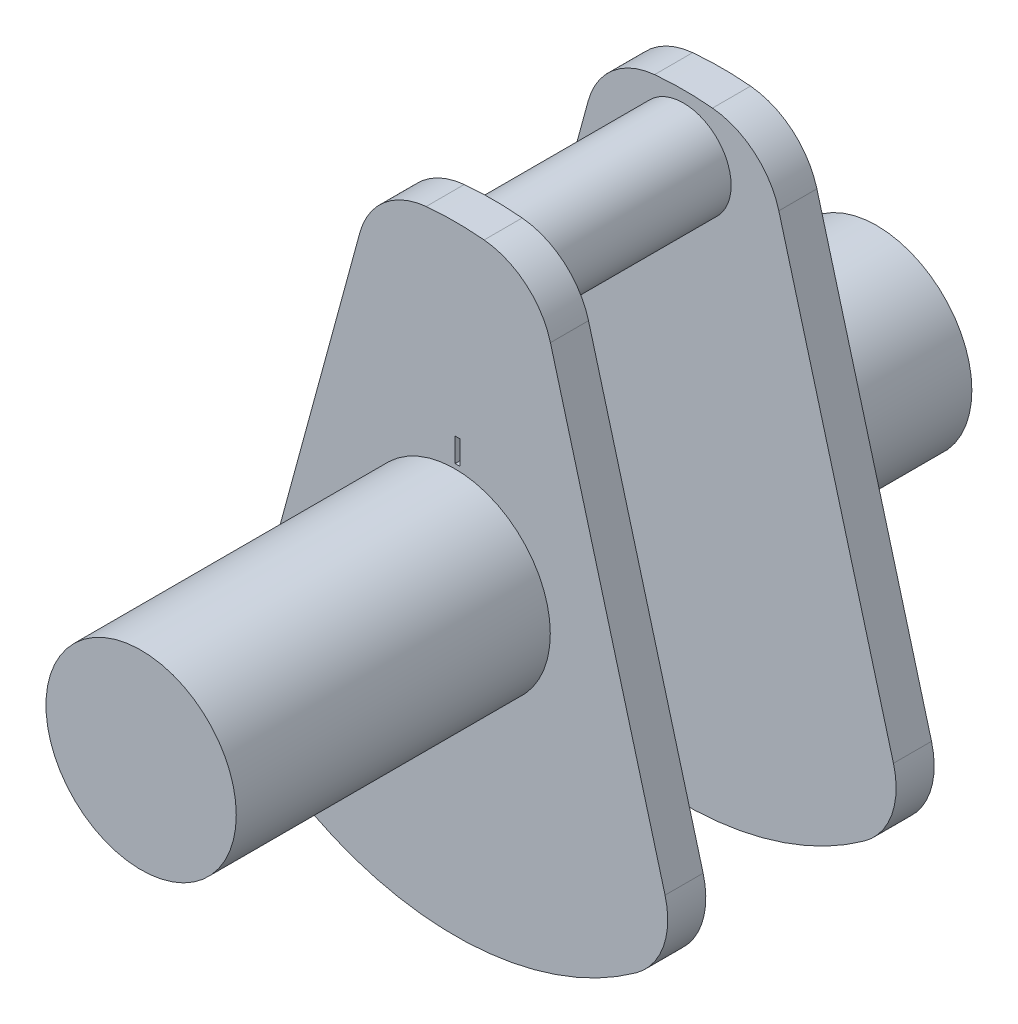
ISO-10303-21;
HEADER;
FILE_DESCRIPTION(('STEP AP214'),'2;1');
FILE_NAME('part.step','',(''),(''),'','','');
FILE_SCHEMA(('AUTOMOTIVE_DESIGN { 1 0 10303 214 1 1 1 1 }'));
ENDSEC;
DATA;
#1=APPLICATION_CONTEXT('core data for automotive mechanical design processes');
#2=APPLICATION_PROTOCOL_DEFINITION('international standard','automotive_design',2000,#1);
#3=PRODUCT_CONTEXT('',#1,'mechanical');
#4=PRODUCT('Part','Part','',(#3));
#5=PRODUCT_RELATED_PRODUCT_CATEGORY('part','',(#4));
#6=PRODUCT_DEFINITION_FORMATION('','',#4);
#7=PRODUCT_DEFINITION_CONTEXT('part definition',#1,'design');
#8=PRODUCT_DEFINITION('design','',#6,#7);
#9=PRODUCT_DEFINITION_SHAPE('','',#8);
#10=(LENGTH_UNIT() NAMED_UNIT(*) SI_UNIT(.MILLI.,.METRE.));
#11=(NAMED_UNIT(*) PLANE_ANGLE_UNIT() SI_UNIT($,.RADIAN.));
#12=(NAMED_UNIT(*) SI_UNIT($,.STERADIAN.) SOLID_ANGLE_UNIT());
#13=UNCERTAINTY_MEASURE_WITH_UNIT(LENGTH_MEASURE(1.E-05),#10,'distance_accuracy_value','');
#14=(GEOMETRIC_REPRESENTATION_CONTEXT(3) GLOBAL_UNCERTAINTY_ASSIGNED_CONTEXT((#13)) GLOBAL_UNIT_ASSIGNED_CONTEXT((#10,
#11,#12)) REPRESENTATION_CONTEXT('',''));
#15=CARTESIAN_POINT('',(0.,0.,0.));
#16=DIRECTION('',(0.,0.,1.));
#17=DIRECTION('',(1.,0.,0.));
#18=AXIS2_PLACEMENT_3D('',#15,#16,#17);
#19=CARTESIAN_POINT('',(0.459000000000004,3.78337793824868,36.9249720179287));
#20=DIRECTION('',(0.,0.,-1.));
#21=DIRECTION('',(-1.,0.,0.));
#22=AXIS2_PLACEMENT_3D('',#19,#20,#21);
#23=CYLINDRICAL_SURFACE('',#22,1.6);
#24=CARTESIAN_POINT('',(0.459000000000004,3.78337793824868,36.1249720179287));
#25=DIRECTION('',(0.,0.,1.));
#26=DIRECTION('',(1.,0.,0.));
#27=AXIS2_PLACEMENT_3D('',#24,#25,#26);
#28=CIRCLE('',#27,1.6);
#29=CARTESIAN_POINT('',(2.00284320160388,4.20355429272558,36.1249720179287));
#30=VERTEX_POINT('',#29);
#31=CARTESIAN_POINT('',(0.608877551020411,5.37634269608236,36.1249720179287));
#32=VERTEX_POINT('',#31);
#33=EDGE_CURVE('E164',#30,#32,#28,.T.);
#34=ORIENTED_EDGE('',*,*,#33,.T.);
#35=DIRECTION('',(0.,0.,-1.));
#36=VECTOR('',#35,1.);
#37=CARTESIAN_POINT('',(0.608877551020411,5.37634269608236,36.9249720179287));
#38=LINE('',#37,#36);
#39=CARTESIAN_POINT('',(0.608877551020411,5.37634269608236,36.9249720179287));
#40=VERTEX_POINT('',#39);
#41=EDGE_CURVE('E57',#40,#32,#38,.T.);
#42=ORIENTED_EDGE('',*,*,#41,.F.);
#43=CARTESIAN_POINT('',(0.459000000000004,3.78337793824868,36.9249720179287));
#44=DIRECTION('',(0.,0.,1.));
#45=DIRECTION('',(1.,0.,0.));
#46=AXIS2_PLACEMENT_3D('',#43,#44,#45);
#47=CIRCLE('',#46,1.6);
#48=CARTESIAN_POINT('',(2.00284320160388,4.20355429272558,36.9249720179287));
#49=VERTEX_POINT('',#48);
#50=EDGE_CURVE('E179',#49,#40,#47,.T.);
#51=ORIENTED_EDGE('',*,*,#50,.F.);
#52=DIRECTION('',(0.,0.,-1.));
#53=VECTOR('',#52,1.);
#54=CARTESIAN_POINT('',(2.00284320160388,4.20355429272558,36.9249720179287));
#55=LINE('',#54,#53);
#56=EDGE_CURVE('E159',#49,#30,#55,.T.);
#57=ORIENTED_EDGE('',*,*,#56,.T.);
#58=EDGE_LOOP('',(#34,#42,#51,#57));
#59=FACE_BOUND('',#58,.T.);
#60=ADVANCED_FACE('F50',(#59),#23,.T.);
#61=CARTESIAN_POINT('',(0.,-1.09507663261698,36.9249720179287));
#62=DIRECTION('',(0.,0.,-1.));
#63=DIRECTION('',(-1.,0.,0.));
#64=AXIS2_PLACEMENT_3D('',#61,#62,#63);
#65=CYLINDRICAL_SURFACE('',#64,6.5);
#66=CARTESIAN_POINT('',(0.,-1.09507663261698,36.1249720179287));
#67=DIRECTION('',(0.,0.,1.));
#68=DIRECTION('',(1.,0.,0.));
#69=AXIS2_PLACEMENT_3D('',#66,#67,#68);
#70=CIRCLE('',#69,6.5);
#71=CARTESIAN_POINT('',(-0.608877551020403,5.37634269608236,36.1249720179287));
#72=VERTEX_POINT('',#71);
#73=EDGE_CURVE('E363',#32,#72,#70,.T.);
#74=ORIENTED_EDGE('',*,*,#73,.T.);
#75=DIRECTION('',(0.,0.,-1.));
#76=VECTOR('',#75,1.);
#77=CARTESIAN_POINT('',(-0.608877551020403,5.37634269608236,36.9249720179287));
#78=LINE('',#77,#76);
#79=CARTESIAN_POINT('',(-0.608877551020403,5.37634269608236,36.9249720179287));
#80=VERTEX_POINT('',#79);
#81=EDGE_CURVE('E196',#80,#72,#78,.T.);
#82=ORIENTED_EDGE('',*,*,#81,.F.);
#83=CARTESIAN_POINT('',(0.,-1.09507663261698,36.9249720179287));
#84=DIRECTION('',(0.,0.,1.));
#85=DIRECTION('',(1.,0.,0.));
#86=AXIS2_PLACEMENT_3D('',#83,#84,#85);
#87=CIRCLE('',#86,6.5);
#88=EDGE_CURVE('E115',#40,#80,#87,.T.);
#89=ORIENTED_EDGE('',*,*,#88,.F.);
#90=ORIENTED_EDGE('',*,*,#41,.T.);
#91=EDGE_LOOP('',(#74,#82,#89,#90));
#92=FACE_BOUND('',#91,.T.);
#93=ADVANCED_FACE('F384',(#92),#65,.T.);
#94=CARTESIAN_POINT('',(-0.458999999999996,3.78337793824868,36.9249720179287));
#95=DIRECTION('',(0.,0.,-1.));
#96=DIRECTION('',(-1.,0.,0.));
#97=AXIS2_PLACEMENT_3D('',#94,#95,#96);
#98=CYLINDRICAL_SURFACE('',#97,1.6);
#99=CARTESIAN_POINT('',(-0.458999999999996,3.78337793824868,36.1249720179287));
#100=DIRECTION('',(0.,0.,1.));
#101=DIRECTION('',(-1.,0.,0.));
#102=AXIS2_PLACEMENT_3D('',#99,#100,#101);
#103=CIRCLE('',#102,1.6);
#104=CARTESIAN_POINT('',(-2.00284320160387,4.20355429272557,36.1249720179287));
#105=VERTEX_POINT('',#104);
#106=EDGE_CURVE('E368',#72,#105,#103,.T.);
#107=ORIENTED_EDGE('',*,*,#106,.T.);
#108=DIRECTION('',(0.,0.,-1.));
#109=VECTOR('',#108,1.);
#110=CARTESIAN_POINT('',(-2.00284320160387,4.20355429272557,36.9249720179287));
#111=LINE('',#110,#109);
#112=CARTESIAN_POINT('',(-2.00284320160387,4.20355429272557,36.9249720179287));
#113=VERTEX_POINT('',#112);
#114=EDGE_CURVE('E192',#113,#105,#111,.T.);
#115=ORIENTED_EDGE('',*,*,#114,.F.);
#116=CARTESIAN_POINT('',(-0.458999999999996,3.78337793824868,36.9249720179287));
#117=DIRECTION('',(0.,0.,1.));
#118=DIRECTION('',(-1.,0.,0.));
#119=AXIS2_PLACEMENT_3D('',#116,#117,#118);
#120=CIRCLE('',#119,1.6);
#121=EDGE_CURVE('E219',#80,#113,#120,.T.);
#122=ORIENTED_EDGE('',*,*,#121,.F.);
#123=ORIENTED_EDGE('',*,*,#81,.T.);
#124=EDGE_LOOP('',(#107,#115,#122,#123));
#125=FACE_BOUND('',#124,.T.);
#126=ADVANCED_FACE('F386',(#125),#98,.T.);
#127=CARTESIAN_POINT('',(-2.00284320160387,4.20355429272557,36.9249720179287));
#128=DIRECTION('',(0.964902001002423,-0.26261022154806,0.));
#129=DIRECTION('',(0.26261022154806,0.964902001002423,0.));
#130=AXIS2_PLACEMENT_3D('',#127,#128,#129);
#131=PLANE('',#130);
#132=DIRECTION('',(-0.26261022154806,-0.964902001002423,0.));
#133=VECTOR('',#132,1.);
#134=CARTESIAN_POINT('',(-2.00284320160387,4.20355429272557,36.1249720179287));
#135=LINE('',#134,#133);
#136=CARTESIAN_POINT('',(-4.41186786120332,-4.64786322182952,36.1249720179287));
#137=VERTEX_POINT('',#136);
#138=EDGE_CURVE('E370',#105,#137,#135,.T.);
#139=ORIENTED_EDGE('',*,*,#138,.T.);
#140=DIRECTION('',(0.,0.,-1.));
#141=VECTOR('',#140,1.);
#142=CARTESIAN_POINT('',(-4.41186786120332,-4.64786322182952,36.9249720179287));
#143=LINE('',#142,#141);
#144=CARTESIAN_POINT('',(-4.41186786120332,-4.64786322182952,36.9249720179287));
#145=VERTEX_POINT('',#144);
#146=EDGE_CURVE('E188',#145,#137,#143,.T.);
#147=ORIENTED_EDGE('',*,*,#146,.F.);
#148=DIRECTION('',(-0.26261022154806,-0.964902001002423,0.));
#149=VECTOR('',#148,1.);
#150=CARTESIAN_POINT('',(-2.00284320160387,4.20355429272557,36.9249720179287));
#151=LINE('',#150,#149);
#152=EDGE_CURVE('E389',#113,#145,#151,.T.);
#153=ORIENTED_EDGE('',*,*,#152,.F.);
#154=ORIENTED_EDGE('',*,*,#114,.T.);
#155=EDGE_LOOP('',(#139,#147,#153,#154));
#156=FACE_BOUND('',#155,.T.);
#157=ADVANCED_FACE('F395',(#156),#131,.F.);
#158=CARTESIAN_POINT('',(-2.86802465959945,-5.06803957630642,36.9249720179287));
#159=DIRECTION('',(0.,0.,-1.));
#160=DIRECTION('',(-1.,0.,0.));
#161=AXIS2_PLACEMENT_3D('',#158,#159,#160);
#162=CYLINDRICAL_SURFACE('',#161,1.6);
#163=CARTESIAN_POINT('',(-2.86802465959945,-5.06803957630642,36.1249720179287));
#164=DIRECTION('',(0.,0.,1.));
#165=DIRECTION('',(1.,0.,0.));
#166=AXIS2_PLACEMENT_3D('',#163,#164,#165);
#167=CIRCLE('',#166,1.6);
#168=CARTESIAN_POINT('',(-3.80452250763193,-6.36533359873562,36.1249720179287));
#169=VERTEX_POINT('',#168);
#170=EDGE_CURVE('E376',#137,#169,#167,.T.);
#171=ORIENTED_EDGE('',*,*,#170,.T.);
#172=DIRECTION('',(0.,0.,-1.));
#173=VECTOR('',#172,1.);
#174=CARTESIAN_POINT('',(-3.80452250763193,-6.36533359873562,36.9249720179287));
#175=LINE('',#174,#173);
#176=CARTESIAN_POINT('',(-3.80452250763193,-6.36533359873562,36.9249720179287));
#177=VERTEX_POINT('',#176);
#178=EDGE_CURVE('E152',#177,#169,#175,.T.);
#179=ORIENTED_EDGE('',*,*,#178,.F.);
#180=CARTESIAN_POINT('',(-2.86802465959945,-5.06803957630642,36.9249720179287));
#181=DIRECTION('',(0.,0.,1.));
#182=DIRECTION('',(1.,0.,0.));
#183=AXIS2_PLACEMENT_3D('',#180,#181,#182);
#184=CIRCLE('',#183,1.6);
#185=EDGE_CURVE('E138',#145,#177,#184,.T.);
#186=ORIENTED_EDGE('',*,*,#185,.F.);
#187=ORIENTED_EDGE('',*,*,#146,.T.);
#188=EDGE_LOOP('',(#171,#179,#186,#187));
#189=FACE_BOUND('',#188,.T.);
#190=ADVANCED_FACE('F399',(#189),#162,.T.);
#191=CARTESIAN_POINT('',(0.,-1.09507663261698,36.9249720179287));
#192=DIRECTION('',(0.,0.,-1.));
#193=DIRECTION('',(-1.,0.,0.));
#194=AXIS2_PLACEMENT_3D('',#191,#192,#193);
#195=CYLINDRICAL_SURFACE('',#194,6.5);
#196=CARTESIAN_POINT('',(0.,-1.09507663261698,36.1249720179287));
#197=DIRECTION('',(0.,0.,1.));
#198=DIRECTION('',(1.,0.,0.));
#199=AXIS2_PLACEMENT_3D('',#196,#197,#198);
#200=CIRCLE('',#199,6.5);
#201=CARTESIAN_POINT('',(3.80452250763193,-6.36533359873562,36.1249720179287));
#202=VERTEX_POINT('',#201);
#203=EDGE_CURVE('E148',#169,#202,#200,.T.);
#204=ORIENTED_EDGE('',*,*,#203,.T.);
#205=DIRECTION('',(0.,0.,-1.));
#206=VECTOR('',#205,1.);
#207=CARTESIAN_POINT('',(3.80452250763193,-6.36533359873562,36.9249720179287));
#208=LINE('',#207,#206);
#209=CARTESIAN_POINT('',(3.80452250763193,-6.36533359873562,36.9249720179287));
#210=VERTEX_POINT('',#209);
#211=EDGE_CURVE('E145',#210,#202,#208,.T.);
#212=ORIENTED_EDGE('',*,*,#211,.F.);
#213=CARTESIAN_POINT('',(0.,-1.09507663261698,36.9249720179287));
#214=DIRECTION('',(0.,0.,1.));
#215=DIRECTION('',(1.,0.,0.));
#216=AXIS2_PLACEMENT_3D('',#213,#214,#215);
#217=CIRCLE('',#216,6.5);
#218=EDGE_CURVE('E131',#177,#210,#217,.T.);
#219=ORIENTED_EDGE('',*,*,#218,.F.);
#220=ORIENTED_EDGE('',*,*,#178,.T.);
#221=EDGE_LOOP('',(#204,#212,#219,#220));
#222=FACE_BOUND('',#221,.T.);
#223=ADVANCED_FACE('F146',(#222),#195,.T.);
#224=CARTESIAN_POINT('',(2.86802465959946,-5.06803957630641,36.9249720179287));
#225=DIRECTION('',(0.,0.,-1.));
#226=DIRECTION('',(-1.,0.,0.));
#227=AXIS2_PLACEMENT_3D('',#224,#225,#226);
#228=CYLINDRICAL_SURFACE('',#227,1.6);
#229=CARTESIAN_POINT('',(2.86802465959946,-5.06803957630641,36.1249720179287));
#230=DIRECTION('',(0.,0.,1.));
#231=DIRECTION('',(-1.,0.,0.));
#232=AXIS2_PLACEMENT_3D('',#229,#230,#231);
#233=CIRCLE('',#232,1.6);
#234=CARTESIAN_POINT('',(4.41186786120333,-4.64786322182952,36.1249720179287));
#235=VERTEX_POINT('',#234);
#236=EDGE_CURVE('E180',#202,#235,#233,.T.);
#237=ORIENTED_EDGE('',*,*,#236,.T.);
#238=DIRECTION('',(0.,0.,-1.));
#239=VECTOR('',#238,1.);
#240=CARTESIAN_POINT('',(4.41186786120333,-4.64786322182952,36.9249720179287));
#241=LINE('',#240,#239);
#242=CARTESIAN_POINT('',(4.41186786120333,-4.64786322182952,36.9249720179287));
#243=VERTEX_POINT('',#242);
#244=EDGE_CURVE('E153',#243,#235,#241,.T.);
#245=ORIENTED_EDGE('',*,*,#244,.F.);
#246=CARTESIAN_POINT('',(2.86802465959946,-5.06803957630641,36.9249720179287));
#247=DIRECTION('',(0.,0.,1.));
#248=DIRECTION('',(-1.,0.,0.));
#249=AXIS2_PLACEMENT_3D('',#246,#247,#248);
#250=CIRCLE('',#249,1.6);
#251=EDGE_CURVE('E135',#210,#243,#250,.T.);
#252=ORIENTED_EDGE('',*,*,#251,.F.);
#253=ORIENTED_EDGE('',*,*,#211,.T.);
#254=EDGE_LOOP('',(#237,#245,#252,#253));
#255=FACE_BOUND('',#254,.T.);
#256=ADVANCED_FACE('F155',(#255),#228,.T.);
#257=CARTESIAN_POINT('',(2.00284320160388,4.20355429272558,36.9249720179287));
#258=DIRECTION('',(-0.964902001002423,-0.26261022154806,0.));
#259=DIRECTION('',(0.26261022154806,-0.964902001002423,0.));
#260=AXIS2_PLACEMENT_3D('',#257,#258,#259);
#261=PLANE('',#260);
#262=DIRECTION('',(-0.26261022154806,0.964902001002423,0.));
#263=VECTOR('',#262,1.);
#264=CARTESIAN_POINT('',(2.00284320160388,4.20355429272558,36.1249720179287));
#265=LINE('',#264,#263);
#266=EDGE_CURVE('E106',#235,#30,#265,.T.);
#267=ORIENTED_EDGE('',*,*,#266,.T.);
#268=ORIENTED_EDGE('',*,*,#56,.F.);
#269=DIRECTION('',(-0.26261022154806,0.964902001002423,0.));
#270=VECTOR('',#269,1.);
#271=CARTESIAN_POINT('',(2.00284320160388,4.20355429272558,36.9249720179287));
#272=LINE('',#271,#270);
#273=EDGE_CURVE('E73',#243,#49,#272,.T.);
#274=ORIENTED_EDGE('',*,*,#273,.F.);
#275=ORIENTED_EDGE('',*,*,#244,.T.);
#276=EDGE_LOOP('',(#267,#268,#274,#275));
#277=FACE_BOUND('',#276,.T.);
#278=ADVANCED_FACE('F380',(#277),#261,.F.);
#279=CARTESIAN_POINT('',(0.459000000000004,3.78337793824868,36.9249720179287));
#280=DIRECTION('',(0.,0.,1.));
#281=DIRECTION('',(1.,0.,0.));
#282=AXIS2_PLACEMENT_3D('',#279,#280,#281);
#283=PLANE('',#282);
#284=CARTESIAN_POINT('',(0.,4.16392336738302,36.9249720179287));
#285=DIRECTION('',(0.,0.,1.));
#286=DIRECTION('',(1.,0.,0.));
#287=AXIS2_PLACEMENT_3D('',#284,#285,#286);
#288=CIRCLE('',#287,1.);
#289=CARTESIAN_POINT('',(1.00000000000001,4.16392336738302,36.9249720179287));
#290=VERTEX_POINT('',#289);
#291=EDGE_CURVE('E206',#290,#290,#288,.T.);
#292=ORIENTED_EDGE('',*,*,#291,.F.);
#293=EDGE_LOOP('',(#292));
#294=FACE_BOUND('',#293,.T.);
#295=ORIENTED_EDGE('',*,*,#50,.T.);
#296=ORIENTED_EDGE('',*,*,#88,.T.);
#297=ORIENTED_EDGE('',*,*,#121,.T.);
#298=ORIENTED_EDGE('',*,*,#152,.T.);
#299=ORIENTED_EDGE('',*,*,#185,.T.);
#300=ORIENTED_EDGE('',*,*,#218,.T.);
#301=ORIENTED_EDGE('',*,*,#251,.T.);
#302=ORIENTED_EDGE('',*,*,#273,.T.);
#303=EDGE_LOOP('',(#295,#296,#297,#298,#299,#300,#301,#302));
#304=FACE_BOUND('',#303,.T.);
#305=ADVANCED_FACE('F133',(#294,#304),#283,.T.);
#306=CARTESIAN_POINT('',(0.459000000000004,3.78337793824868,36.1249720179287));
#307=DIRECTION('',(0.,0.,1.));
#308=DIRECTION('',(1.,0.,0.));
#309=AXIS2_PLACEMENT_3D('',#306,#307,#308);
#310=PLANE('',#309);
#311=CARTESIAN_POINT('',(0.,-1.09507663261698,36.1249720179287));
#312=DIRECTION('',(0.,0.,1.));
#313=DIRECTION('',(1.,0.,0.));
#314=AXIS2_PLACEMENT_3D('',#311,#312,#313);
#315=CIRCLE('',#314,2.);
#316=CARTESIAN_POINT('',(2.,-1.09507663261698,36.1249720179287));
#317=VERTEX_POINT('',#316);
#318=EDGE_CURVE('E12',#317,#317,#315,.F.);
#319=ORIENTED_EDGE('',*,*,#318,.F.);
#320=EDGE_LOOP('',(#319));
#321=FACE_BOUND('',#320,.T.);
#322=ORIENTED_EDGE('',*,*,#33,.F.);
#323=ORIENTED_EDGE('',*,*,#266,.F.);
#324=ORIENTED_EDGE('',*,*,#236,.F.);
#325=ORIENTED_EDGE('',*,*,#203,.F.);
#326=ORIENTED_EDGE('',*,*,#170,.F.);
#327=ORIENTED_EDGE('',*,*,#138,.F.);
#328=ORIENTED_EDGE('',*,*,#106,.F.);
#329=ORIENTED_EDGE('',*,*,#73,.F.);
#330=EDGE_LOOP('',(#322,#323,#324,#325,#326,#327,#328,#329));
#331=FACE_BOUND('',#330,.T.);
#332=ADVANCED_FACE('F356',(#321,#331),#310,.F.);
#333=CARTESIAN_POINT('',(0.,4.16392336738302,38.9249720179287));
#334=DIRECTION('',(0.,0.,-1.));
#335=DIRECTION('',(-1.,0.,0.));
#336=AXIS2_PLACEMENT_3D('',#333,#334,#335);
#337=CYLINDRICAL_SURFACE('',#336,1.);
#338=ORIENTED_EDGE('',*,*,#291,.T.);
#339=EDGE_LOOP('',(#338));
#340=FACE_BOUND('',#339,.T.);
#341=CARTESIAN_POINT('',(0.,4.16392336738302,40.9249720179287));
#342=DIRECTION('',(0.,0.,1.));
#343=DIRECTION('',(1.,0.,0.));
#344=AXIS2_PLACEMENT_3D('',#341,#342,#343);
#345=CIRCLE('',#344,1.);
#346=CARTESIAN_POINT('',(1.00000000000001,4.16392336738302,40.9249720179287));
#347=VERTEX_POINT('',#346);
#348=EDGE_CURVE('E266',#347,#347,#345,.T.);
#349=ORIENTED_EDGE('',*,*,#348,.F.);
#350=EDGE_LOOP('',(#349));
#351=FACE_BOUND('',#350,.T.);
#352=ADVANCED_FACE('F352',(#340,#351),#337,.T.);
#353=CARTESIAN_POINT('',(0.,-1.09507663261698,32.8649720179287));
#354=DIRECTION('',(0.,0.,1.));
#355=DIRECTION('',(1.,0.,0.));
#356=AXIS2_PLACEMENT_3D('',#353,#354,#355);
#357=CYLINDRICAL_SURFACE('',#356,2.);
#358=CARTESIAN_POINT('',(0.,-1.09507663261698,32.8649720179287));
#359=DIRECTION('',(0.,0.,-1.));
#360=DIRECTION('',(-1.,0.,0.));
#361=AXIS2_PLACEMENT_3D('',#358,#359,#360);
#362=CIRCLE('',#361,2.);
#363=CARTESIAN_POINT('',(-2.,-1.09507663261698,32.8649720179287));
#364=VERTEX_POINT('',#363);
#365=EDGE_CURVE('E212',#364,#364,#362,.T.);
#366=ORIENTED_EDGE('',*,*,#365,.F.);
#367=EDGE_LOOP('',(#366));
#368=FACE_BOUND('',#367,.T.);
#369=ORIENTED_EDGE('',*,*,#318,.T.);
#370=EDGE_LOOP('',(#369));
#371=FACE_BOUND('',#370,.T.);
#372=ADVANCED_FACE('F349',(#368,#371),#357,.T.);
#373=CARTESIAN_POINT('',(0.,-1.09507663261698,32.8649720179287));
#374=DIRECTION('',(0.,0.,-1.));
#375=DIRECTION('',(-1.,0.,0.));
#376=AXIS2_PLACEMENT_3D('',#373,#374,#375);
#377=PLANE('',#376);
#378=ORIENTED_EDGE('',*,*,#365,.T.);
#379=EDGE_LOOP('',(#378));
#380=FACE_BOUND('',#379,.T.);
#381=ADVANCED_FACE('F347',(#380),#377,.T.);
#382=CARTESIAN_POINT('',(0.459000000000004,3.78337793824868,40.9249720179287));
#383=DIRECTION('',(0.,0.,1.));
#384=DIRECTION('',(-1.,0.,0.));
#385=AXIS2_PLACEMENT_3D('',#382,#383,#384);
#386=CYLINDRICAL_SURFACE('',#385,1.6);
#387=CARTESIAN_POINT('',(0.459000000000004,3.78337793824868,41.7249720179287));
#388=DIRECTION('',(0.,0.,1.));
#389=DIRECTION('',(1.,0.,0.));
#390=AXIS2_PLACEMENT_3D('',#387,#388,#389);
#391=CIRCLE('',#390,1.6);
#392=CARTESIAN_POINT('',(2.00284320160388,4.20355429272558,41.7249720179287));
#393=VERTEX_POINT('',#392);
#394=CARTESIAN_POINT('',(0.608877551020411,5.37634269608236,41.7249720179287));
#395=VERTEX_POINT('',#394);
#396=EDGE_CURVE('E252',#393,#395,#391,.T.);
#397=ORIENTED_EDGE('',*,*,#396,.F.);
#398=DIRECTION('',(0.,0.,1.));
#399=VECTOR('',#398,1.);
#400=CARTESIAN_POINT('',(2.00284320160388,4.20355429272558,40.9249720179287));
#401=LINE('',#400,#399);
#402=CARTESIAN_POINT('',(2.00284320160388,4.20355429272558,40.9249720179287));
#403=VERTEX_POINT('',#402);
#404=EDGE_CURVE('E251',#403,#393,#401,.T.);
#405=ORIENTED_EDGE('',*,*,#404,.F.);
#406=CARTESIAN_POINT('',(0.459000000000004,3.78337793824868,40.9249720179287));
#407=DIRECTION('',(0.,0.,1.));
#408=DIRECTION('',(1.,0.,0.));
#409=AXIS2_PLACEMENT_3D('',#406,#407,#408);
#410=CIRCLE('',#409,1.6);
#411=CARTESIAN_POINT('',(0.608877551020411,5.37634269608236,40.9249720179287));
#412=VERTEX_POINT('',#411);
#413=EDGE_CURVE('E273',#403,#412,#410,.T.);
#414=ORIENTED_EDGE('',*,*,#413,.T.);
#415=DIRECTION('',(0.,0.,1.));
#416=VECTOR('',#415,1.);
#417=CARTESIAN_POINT('',(0.608877551020411,5.37634269608236,40.9249720179287));
#418=LINE('',#417,#416);
#419=EDGE_CURVE('E336',#412,#395,#418,.T.);
#420=ORIENTED_EDGE('',*,*,#419,.T.);
#421=EDGE_LOOP('',(#397,#405,#414,#420));
#422=FACE_BOUND('',#421,.T.);
#423=ADVANCED_FACE('F498',(#422),#386,.T.);
#424=CARTESIAN_POINT('',(0.,-1.09507663261698,40.9249720179287));
#425=DIRECTION('',(0.,0.,1.));
#426=DIRECTION('',(-1.,0.,0.));
#427=AXIS2_PLACEMENT_3D('',#424,#425,#426);
#428=CYLINDRICAL_SURFACE('',#427,6.5);
#429=CARTESIAN_POINT('',(0.,-1.09507663261698,41.7249720179287));
#430=DIRECTION('',(0.,0.,1.));
#431=DIRECTION('',(1.,0.,0.));
#432=AXIS2_PLACEMENT_3D('',#429,#430,#431);
#433=CIRCLE('',#432,6.5);
#434=CARTESIAN_POINT('',(-0.608877551020403,5.37634269608236,41.7249720179287));
#435=VERTEX_POINT('',#434);
#436=EDGE_CURVE('E797',#395,#435,#433,.T.);
#437=ORIENTED_EDGE('',*,*,#436,.F.);
#438=ORIENTED_EDGE('',*,*,#419,.F.);
#439=CARTESIAN_POINT('',(0.,-1.09507663261698,40.9249720179287));
#440=DIRECTION('',(0.,0.,1.));
#441=DIRECTION('',(1.,0.,0.));
#442=AXIS2_PLACEMENT_3D('',#439,#440,#441);
#443=CIRCLE('',#442,6.5);
#444=CARTESIAN_POINT('',(-0.608877551020403,5.37634269608236,40.9249720179287));
#445=VERTEX_POINT('',#444);
#446=EDGE_CURVE('E278',#412,#445,#443,.T.);
#447=ORIENTED_EDGE('',*,*,#446,.T.);
#448=DIRECTION('',(0.,0.,1.));
#449=VECTOR('',#448,1.);
#450=CARTESIAN_POINT('',(-0.608877551020403,5.37634269608236,40.9249720179287));
#451=LINE('',#450,#449);
#452=EDGE_CURVE('E333',#445,#435,#451,.T.);
#453=ORIENTED_EDGE('',*,*,#452,.T.);
#454=EDGE_LOOP('',(#437,#438,#447,#453));
#455=FACE_BOUND('',#454,.T.);
#456=ADVANCED_FACE('F509',(#455),#428,.T.);
#457=CARTESIAN_POINT('',(-0.458999999999996,3.78337793824868,40.9249720179287));
#458=DIRECTION('',(0.,0.,1.));
#459=DIRECTION('',(-1.,0.,0.));
#460=AXIS2_PLACEMENT_3D('',#457,#458,#459);
#461=CYLINDRICAL_SURFACE('',#460,1.6);
#462=CARTESIAN_POINT('',(-0.458999999999996,3.78337793824868,41.7249720179287));
#463=DIRECTION('',(0.,0.,1.));
#464=DIRECTION('',(-1.,0.,0.));
#465=AXIS2_PLACEMENT_3D('',#462,#463,#464);
#466=CIRCLE('',#465,1.6);
#467=CARTESIAN_POINT('',(-2.00284320160387,4.20355429272557,41.7249720179287));
#468=VERTEX_POINT('',#467);
#469=EDGE_CURVE('E794',#435,#468,#466,.T.);
#470=ORIENTED_EDGE('',*,*,#469,.F.);
#471=ORIENTED_EDGE('',*,*,#452,.F.);
#472=CARTESIAN_POINT('',(-0.458999999999996,3.78337793824868,40.9249720179287));
#473=DIRECTION('',(0.,0.,1.));
#474=DIRECTION('',(-1.,0.,0.));
#475=AXIS2_PLACEMENT_3D('',#472,#473,#474);
#476=CIRCLE('',#475,1.6);
#477=CARTESIAN_POINT('',(-2.00284320160387,4.20355429272557,40.9249720179287));
#478=VERTEX_POINT('',#477);
#479=EDGE_CURVE('E232',#445,#478,#476,.T.);
#480=ORIENTED_EDGE('',*,*,#479,.T.);
#481=DIRECTION('',(0.,0.,1.));
#482=VECTOR('',#481,1.);
#483=CARTESIAN_POINT('',(-2.00284320160387,4.20355429272557,40.9249720179287));
#484=LINE('',#483,#482);
#485=EDGE_CURVE('E329',#478,#468,#484,.T.);
#486=ORIENTED_EDGE('',*,*,#485,.T.);
#487=EDGE_LOOP('',(#470,#471,#480,#486));
#488=FACE_BOUND('',#487,.T.);
#489=ADVANCED_FACE('F517',(#488),#461,.T.);
#490=CARTESIAN_POINT('',(-2.00284320160387,4.20355429272557,40.9249720179287));
#491=DIRECTION('',(0.964902001002423,-0.26261022154806,0.));
#492=DIRECTION('',(0.26261022154806,0.964902001002423,0.));
#493=AXIS2_PLACEMENT_3D('',#490,#491,#492);
#494=PLANE('',#493);
#495=DIRECTION('',(-0.26261022154806,-0.964902001002423,0.));
#496=VECTOR('',#495,1.);
#497=CARTESIAN_POINT('',(-2.00284320160387,4.20355429272557,41.7249720179287));
#498=LINE('',#497,#496);
#499=CARTESIAN_POINT('',(-4.41186786120332,-4.64786322182952,41.7249720179287));
#500=VERTEX_POINT('',#499);
#501=EDGE_CURVE('E788',#468,#500,#498,.T.);
#502=ORIENTED_EDGE('',*,*,#501,.F.);
#503=ORIENTED_EDGE('',*,*,#485,.F.);
#504=DIRECTION('',(-0.26261022154806,-0.964902001002423,0.));
#505=VECTOR('',#504,1.);
#506=CARTESIAN_POINT('',(-2.00284320160387,4.20355429272557,40.9249720179287));
#507=LINE('',#506,#505);
#508=CARTESIAN_POINT('',(-4.41186786120332,-4.64786322182952,40.9249720179287));
#509=VERTEX_POINT('',#508);
#510=EDGE_CURVE('E226',#478,#509,#507,.T.);
#511=ORIENTED_EDGE('',*,*,#510,.T.);
#512=DIRECTION('',(0.,0.,1.));
#513=VECTOR('',#512,1.);
#514=CARTESIAN_POINT('',(-4.41186786120332,-4.64786322182952,40.9249720179287));
#515=LINE('',#514,#513);
#516=EDGE_CURVE('E325',#509,#500,#515,.T.);
#517=ORIENTED_EDGE('',*,*,#516,.T.);
#518=EDGE_LOOP('',(#502,#503,#511,#517));
#519=FACE_BOUND('',#518,.T.);
#520=ADVANCED_FACE('F526',(#519),#494,.F.);
#521=CARTESIAN_POINT('',(-2.86802465959945,-5.06803957630642,40.9249720179287));
#522=DIRECTION('',(0.,0.,1.));
#523=DIRECTION('',(-1.,0.,0.));
#524=AXIS2_PLACEMENT_3D('',#521,#522,#523);
#525=CYLINDRICAL_SURFACE('',#524,1.6);
#526=CARTESIAN_POINT('',(-2.86802465959945,-5.06803957630642,41.7249720179287));
#527=DIRECTION('',(0.,0.,1.));
#528=DIRECTION('',(1.,0.,0.));
#529=AXIS2_PLACEMENT_3D('',#526,#527,#528);
#530=CIRCLE('',#529,1.6);
#531=CARTESIAN_POINT('',(-3.80452250763193,-6.36533359873562,41.7249720179287));
#532=VERTEX_POINT('',#531);
#533=EDGE_CURVE('E784',#500,#532,#530,.T.);
#534=ORIENTED_EDGE('',*,*,#533,.F.);
#535=ORIENTED_EDGE('',*,*,#516,.F.);
#536=CARTESIAN_POINT('',(-2.86802465959945,-5.06803957630642,40.9249720179287));
#537=DIRECTION('',(0.,0.,1.));
#538=DIRECTION('',(1.,0.,0.));
#539=AXIS2_PLACEMENT_3D('',#536,#537,#538);
#540=CIRCLE('',#539,1.6);
#541=CARTESIAN_POINT('',(-3.80452250763193,-6.36533359873562,40.9249720179287));
#542=VERTEX_POINT('',#541);
#543=EDGE_CURVE('E231',#509,#542,#540,.T.);
#544=ORIENTED_EDGE('',*,*,#543,.T.);
#545=DIRECTION('',(0.,0.,1.));
#546=VECTOR('',#545,1.);
#547=CARTESIAN_POINT('',(-3.80452250763193,-6.36533359873562,40.9249720179287));
#548=LINE('',#547,#546);
#549=EDGE_CURVE('E321',#542,#532,#548,.T.);
#550=ORIENTED_EDGE('',*,*,#549,.T.);
#551=EDGE_LOOP('',(#534,#535,#544,#550));
#552=FACE_BOUND('',#551,.T.);
#553=ADVANCED_FACE('F536',(#552),#525,.T.);
#554=CARTESIAN_POINT('',(0.,-1.09507663261698,40.9249720179287));
#555=DIRECTION('',(0.,0.,1.));
#556=DIRECTION('',(-1.,0.,0.));
#557=AXIS2_PLACEMENT_3D('',#554,#555,#556);
#558=CYLINDRICAL_SURFACE('',#557,6.5);
#559=CARTESIAN_POINT('',(0.,-1.09507663261698,41.7249720179287));
#560=DIRECTION('',(0.,0.,1.));
#561=DIRECTION('',(1.,0.,0.));
#562=AXIS2_PLACEMENT_3D('',#559,#560,#561);
#563=CIRCLE('',#562,6.5);
#564=CARTESIAN_POINT('',(3.80452250763193,-6.36533359873562,41.7249720179287));
#565=VERTEX_POINT('',#564);
#566=EDGE_CURVE('E307',#532,#565,#563,.T.);
#567=ORIENTED_EDGE('',*,*,#566,.F.);
#568=ORIENTED_EDGE('',*,*,#549,.F.);
#569=CARTESIAN_POINT('',(0.,-1.09507663261698,40.9249720179287));
#570=DIRECTION('',(0.,0.,1.));
#571=DIRECTION('',(1.,0.,0.));
#572=AXIS2_PLACEMENT_3D('',#569,#570,#571);
#573=CIRCLE('',#572,6.5);
#574=CARTESIAN_POINT('',(3.80452250763193,-6.36533359873562,40.9249720179287));
#575=VERTEX_POINT('',#574);
#576=EDGE_CURVE('E237',#542,#575,#573,.T.);
#577=ORIENTED_EDGE('',*,*,#576,.T.);
#578=DIRECTION('',(0.,0.,1.));
#579=VECTOR('',#578,1.);
#580=CARTESIAN_POINT('',(3.80452250763193,-6.36533359873562,40.9249720179287));
#581=LINE('',#580,#579);
#582=EDGE_CURVE('E317',#575,#565,#581,.T.);
#583=ORIENTED_EDGE('',*,*,#582,.T.);
#584=EDGE_LOOP('',(#567,#568,#577,#583));
#585=FACE_BOUND('',#584,.T.);
#586=ADVANCED_FACE('F546',(#585),#558,.T.);
#587=CARTESIAN_POINT('',(2.86802465959946,-5.06803957630641,40.9249720179287));
#588=DIRECTION('',(0.,0.,1.));
#589=DIRECTION('',(-1.,0.,0.));
#590=AXIS2_PLACEMENT_3D('',#587,#588,#589);
#591=CYLINDRICAL_SURFACE('',#590,1.6);
#592=CARTESIAN_POINT('',(2.86802465959946,-5.06803957630641,41.7249720179287));
#593=DIRECTION('',(0.,0.,1.));
#594=DIRECTION('',(-1.,0.,0.));
#595=AXIS2_PLACEMENT_3D('',#592,#593,#594);
#596=CIRCLE('',#595,1.6);
#597=CARTESIAN_POINT('',(4.41186786120333,-4.64786322182952,41.7249720179287));
#598=VERTEX_POINT('',#597);
#599=EDGE_CURVE('E299',#565,#598,#596,.T.);
#600=ORIENTED_EDGE('',*,*,#599,.F.);
#601=ORIENTED_EDGE('',*,*,#582,.F.);
#602=CARTESIAN_POINT('',(2.86802465959946,-5.06803957630641,40.9249720179287));
#603=DIRECTION('',(0.,0.,1.));
#604=DIRECTION('',(-1.,0.,0.));
#605=AXIS2_PLACEMENT_3D('',#602,#603,#604);
#606=CIRCLE('',#605,1.6);
#607=CARTESIAN_POINT('',(4.41186786120333,-4.64786322182952,40.9249720179287));
#608=VERTEX_POINT('',#607);
#609=EDGE_CURVE('E242',#575,#608,#606,.T.);
#610=ORIENTED_EDGE('',*,*,#609,.T.);
#611=DIRECTION('',(0.,0.,1.));
#612=VECTOR('',#611,1.);
#613=CARTESIAN_POINT('',(4.41186786120333,-4.64786322182952,40.9249720179287));
#614=LINE('',#613,#612);
#615=EDGE_CURVE('E313',#608,#598,#614,.T.);
#616=ORIENTED_EDGE('',*,*,#615,.T.);
#617=EDGE_LOOP('',(#600,#601,#610,#616));
#618=FACE_BOUND('',#617,.T.);
#619=ADVANCED_FACE('F556',(#618),#591,.T.);
#620=CARTESIAN_POINT('',(2.00284320160388,4.20355429272558,40.9249720179287));
#621=DIRECTION('',(-0.964902001002423,-0.26261022154806,0.));
#622=DIRECTION('',(0.26261022154806,-0.964902001002423,0.));
#623=AXIS2_PLACEMENT_3D('',#620,#621,#622);
#624=PLANE('',#623);
#625=DIRECTION('',(-0.26261022154806,0.964902001002423,0.));
#626=VECTOR('',#625,1.);
#627=CARTESIAN_POINT('',(2.00284320160388,4.20355429272558,41.7249720179287));
#628=LINE('',#627,#626);
#629=EDGE_CURVE('E291',#598,#393,#628,.T.);
#630=ORIENTED_EDGE('',*,*,#629,.F.);
#631=ORIENTED_EDGE('',*,*,#615,.F.);
#632=DIRECTION('',(-0.26261022154806,0.964902001002423,0.));
#633=VECTOR('',#632,1.);
#634=CARTESIAN_POINT('',(2.00284320160388,4.20355429272558,40.9249720179287));
#635=LINE('',#634,#633);
#636=EDGE_CURVE('E246',#608,#403,#635,.T.);
#637=ORIENTED_EDGE('',*,*,#636,.T.);
#638=ORIENTED_EDGE('',*,*,#404,.T.);
#639=EDGE_LOOP('',(#630,#631,#637,#638));
#640=FACE_BOUND('',#639,.T.);
#641=ADVANCED_FACE('F566',(#640),#624,.F.);
#642=CARTESIAN_POINT('',(0.459000000000004,3.78337793824868,40.9249720179287));
#643=DIRECTION('',(0.,0.,-1.));
#644=DIRECTION('',(1.,0.,0.));
#645=AXIS2_PLACEMENT_3D('',#642,#643,#644);
#646=PLANE('',#645);
#647=ORIENTED_EDGE('',*,*,#348,.T.);
#648=EDGE_LOOP('',(#647));
#649=FACE_BOUND('',#648,.T.);
#650=ORIENTED_EDGE('',*,*,#413,.F.);
#651=ORIENTED_EDGE('',*,*,#636,.F.);
#652=ORIENTED_EDGE('',*,*,#609,.F.);
#653=ORIENTED_EDGE('',*,*,#576,.F.);
#654=ORIENTED_EDGE('',*,*,#543,.F.);
#655=ORIENTED_EDGE('',*,*,#510,.F.);
#656=ORIENTED_EDGE('',*,*,#479,.F.);
#657=ORIENTED_EDGE('',*,*,#446,.F.);
#658=EDGE_LOOP('',(#650,#651,#652,#653,#654,#655,#656,#657));
#659=FACE_BOUND('',#658,.T.);
#660=ADVANCED_FACE('F576',(#649,#659),#646,.T.);
#661=CARTESIAN_POINT('',(0.459000000000004,3.78337793824868,41.7249720179287));
#662=DIRECTION('',(0.,0.,-1.));
#663=DIRECTION('',(1.,0.,0.));
#664=AXIS2_PLACEMENT_3D('',#661,#662,#663);
#665=PLANE('',#664);
#666=DIRECTION('',(1.,0.,0.));
#667=VECTOR('',#666,1.);
#668=CARTESIAN_POINT('',(0.,1.00174548209462,41.7249720179287));
#669=LINE('',#668,#667);
#670=CARTESIAN_POINT('',(0.,1.00174548209462,41.7249720179287));
#671=VERTEX_POINT('',#670);
#672=CARTESIAN_POINT('',(0.1,1.00174548209462,41.7249720179287));
#673=VERTEX_POINT('',#672);
#674=EDGE_CURVE('E711',#671,#673,#669,.T.);
#675=ORIENTED_EDGE('',*,*,#674,.F.);
#676=DIRECTION('',(0.,-1.,0.));
#677=VECTOR('',#676,1.);
#678=CARTESIAN_POINT('',(0.,1.50174548209462,41.7249720179287));
#679=LINE('',#678,#677);
#680=CARTESIAN_POINT('',(0.,1.50174548209462,41.7249720179287));
#681=VERTEX_POINT('',#680);
#682=EDGE_CURVE('E64',#681,#671,#679,.T.);
#683=ORIENTED_EDGE('',*,*,#682,.F.);
#684=DIRECTION('',(-1.,0.,0.));
#685=VECTOR('',#684,1.);
#686=CARTESIAN_POINT('',(0.,1.50174548209462,41.7249720179287));
#687=LINE('',#686,#685);
#688=CARTESIAN_POINT('',(0.1,1.50174548209462,41.7249720179287));
#689=VERTEX_POINT('',#688);
#690=EDGE_CURVE('E695',#689,#681,#687,.T.);
#691=ORIENTED_EDGE('',*,*,#690,.F.);
#692=DIRECTION('',(0.,1.,0.));
#693=VECTOR('',#692,1.);
#694=CARTESIAN_POINT('',(0.1,1.50174548209462,41.7249720179287));
#695=LINE('',#694,#693);
#696=EDGE_CURVE('E702',#673,#689,#695,.T.);
#697=ORIENTED_EDGE('',*,*,#696,.F.);
#698=EDGE_LOOP('',(#675,#683,#691,#697));
#699=FACE_BOUND('',#698,.T.);
#700=CARTESIAN_POINT('',(0.,-1.09507663261698,41.7249720179287));
#701=DIRECTION('',(0.,0.,1.));
#702=DIRECTION('',(1.,0.,0.));
#703=AXIS2_PLACEMENT_3D('',#700,#701,#702);
#704=CIRCLE('',#703,2.);
#705=CARTESIAN_POINT('',(2.,-1.09507663261698,41.7249720179287));
#706=VERTEX_POINT('',#705);
#707=EDGE_CURVE('E338',#706,#706,#704,.F.);
#708=ORIENTED_EDGE('',*,*,#707,.T.);
#709=EDGE_LOOP('',(#708));
#710=FACE_BOUND('',#709,.T.);
#711=ORIENTED_EDGE('',*,*,#396,.T.);
#712=ORIENTED_EDGE('',*,*,#436,.T.);
#713=ORIENTED_EDGE('',*,*,#469,.T.);
#714=ORIENTED_EDGE('',*,*,#501,.T.);
#715=ORIENTED_EDGE('',*,*,#533,.T.);
#716=ORIENTED_EDGE('',*,*,#566,.T.);
#717=ORIENTED_EDGE('',*,*,#599,.T.);
#718=ORIENTED_EDGE('',*,*,#629,.T.);
#719=EDGE_LOOP('',(#711,#712,#713,#714,#715,#716,#717,#718));
#720=FACE_BOUND('',#719,.T.);
#721=ADVANCED_FACE('F586',(#699,#710,#720),#665,.F.);
#722=CARTESIAN_POINT('',(0.,-1.09507663261698,44.9849720179287));
#723=DIRECTION('',(0.,0.,-1.));
#724=DIRECTION('',(1.,0.,0.));
#725=AXIS2_PLACEMENT_3D('',#722,#723,#724);
#726=CYLINDRICAL_SURFACE('',#725,2.);
#727=ORIENTED_EDGE('',*,*,#707,.F.);
#728=EDGE_LOOP('',(#727));
#729=FACE_BOUND('',#728,.T.);
#730=CARTESIAN_POINT('',(0.,-1.09507663261698,48.3249720179287));
#731=DIRECTION('',(0.,0.,1.));
#732=DIRECTION('',(1.,0.,0.));
#733=AXIS2_PLACEMENT_3D('',#730,#731,#732);
#734=CIRCLE('',#733,2.);
#735=CARTESIAN_POINT('',(2.,-1.09507663261698,48.3249720179287));
#736=VERTEX_POINT('',#735);
#737=EDGE_CURVE('E260',#736,#736,#734,.T.);
#738=ORIENTED_EDGE('',*,*,#737,.F.);
#739=EDGE_LOOP('',(#738));
#740=FACE_BOUND('',#739,.T.);
#741=ADVANCED_FACE('F594',(#729,#740),#726,.T.);
#742=CARTESIAN_POINT('',(0.,-1.09507663261698,48.3249720179287));
#743=DIRECTION('',(0.,0.,1.));
#744=DIRECTION('',(1.,0.,0.));
#745=AXIS2_PLACEMENT_3D('',#742,#743,#744);
#746=PLANE('',#745);
#747=ORIENTED_EDGE('',*,*,#737,.T.);
#748=EDGE_LOOP('',(#747));
#749=FACE_BOUND('',#748,.T.);
#750=ADVANCED_FACE('F599',(#749),#746,.T.);
#751=CARTESIAN_POINT('',(0.,1.50174548209462,41.6249720179287));
#752=DIRECTION('',(-1.,0.,0.));
#753=DIRECTION('',(0.,-1.,0.));
#754=AXIS2_PLACEMENT_3D('',#751,#752,#753);
#755=PLANE('',#754);
#756=ORIENTED_EDGE('',*,*,#682,.T.);
#757=DIRECTION('',(0.,0.,1.));
#758=VECTOR('',#757,1.);
#759=CARTESIAN_POINT('',(0.,1.00174548209462,41.6249720179287));
#760=LINE('',#759,#758);
#761=CARTESIAN_POINT('',(0.,1.00174548209462,41.6249720179287));
#762=VERTEX_POINT('',#761);
#763=EDGE_CURVE('E268',#762,#671,#760,.T.);
#764=ORIENTED_EDGE('',*,*,#763,.F.);
#765=DIRECTION('',(0.,-1.,0.));
#766=VECTOR('',#765,1.);
#767=CARTESIAN_POINT('',(0.,1.50174548209462,41.6249720179287));
#768=LINE('',#767,#766);
#769=CARTESIAN_POINT('',(0.,1.50174548209462,41.6249720179287));
#770=VERTEX_POINT('',#769);
#771=EDGE_CURVE('E684',#770,#762,#768,.T.);
#772=ORIENTED_EDGE('',*,*,#771,.F.);
#773=DIRECTION('',(0.,0.,1.));
#774=VECTOR('',#773,1.);
#775=CARTESIAN_POINT('',(0.,1.50174548209462,41.6249720179287));
#776=LINE('',#775,#774);
#777=EDGE_CURVE('E267',#770,#681,#776,.T.);
#778=ORIENTED_EDGE('',*,*,#777,.T.);
#779=EDGE_LOOP('',(#756,#764,#772,#778));
#780=FACE_BOUND('',#779,.T.);
#781=ADVANCED_FACE('F608',(#780),#755,.F.);
#782=CARTESIAN_POINT('',(0.,1.50174548209462,41.6249720179287));
#783=DIRECTION('',(0.,1.,0.));
#784=DIRECTION('',(0.,0.,1.));
#785=AXIS2_PLACEMENT_3D('',#782,#783,#784);
#786=PLANE('',#785);
#787=ORIENTED_EDGE('',*,*,#690,.T.);
#788=ORIENTED_EDGE('',*,*,#777,.F.);
#789=DIRECTION('',(-1.,0.,0.));
#790=VECTOR('',#789,1.);
#791=CARTESIAN_POINT('',(0.,1.50174548209462,41.6249720179287));
#792=LINE('',#791,#790);
#793=CARTESIAN_POINT('',(0.1,1.50174548209462,41.6249720179287));
#794=VERTEX_POINT('',#793);
#795=EDGE_CURVE('E691',#794,#770,#792,.T.);
#796=ORIENTED_EDGE('',*,*,#795,.F.);
#797=DIRECTION('',(0.,0.,1.));
#798=VECTOR('',#797,1.);
#799=CARTESIAN_POINT('',(0.1,1.50174548209462,41.6249720179287));
#800=LINE('',#799,#798);
#801=EDGE_CURVE('E720',#794,#689,#800,.T.);
#802=ORIENTED_EDGE('',*,*,#801,.T.);
#803=EDGE_LOOP('',(#787,#788,#796,#802));
#804=FACE_BOUND('',#803,.T.);
#805=ADVANCED_FACE('F627',(#804),#786,.F.);
#806=CARTESIAN_POINT('',(0.1,1.50174548209462,41.6249720179287));
#807=DIRECTION('',(1.,0.,0.));
#808=DIRECTION('',(0.,1.,0.));
#809=AXIS2_PLACEMENT_3D('',#806,#807,#808);
#810=PLANE('',#809);
#811=ORIENTED_EDGE('',*,*,#696,.T.);
#812=ORIENTED_EDGE('',*,*,#801,.F.);
#813=DIRECTION('',(0.,1.,0.));
#814=VECTOR('',#813,1.);
#815=CARTESIAN_POINT('',(0.1,1.50174548209462,41.6249720179287));
#816=LINE('',#815,#814);
#817=CARTESIAN_POINT('',(0.1,1.00174548209462,41.6249720179287));
#818=VERTEX_POINT('',#817);
#819=EDGE_CURVE('E699',#818,#794,#816,.T.);
#820=ORIENTED_EDGE('',*,*,#819,.F.);
#821=DIRECTION('',(0.,0.,1.));
#822=VECTOR('',#821,1.);
#823=CARTESIAN_POINT('',(0.1,1.00174548209462,41.6249720179287));
#824=LINE('',#823,#822);
#825=EDGE_CURVE('E723',#818,#673,#824,.T.);
#826=ORIENTED_EDGE('',*,*,#825,.T.);
#827=EDGE_LOOP('',(#811,#812,#820,#826));
#828=FACE_BOUND('',#827,.T.);
#829=ADVANCED_FACE('F636',(#828),#810,.F.);
#830=CARTESIAN_POINT('',(0.,1.00174548209462,41.6249720179287));
#831=DIRECTION('',(0.,-1.,0.));
#832=DIRECTION('',(0.,0.,-1.));
#833=AXIS2_PLACEMENT_3D('',#830,#831,#832);
#834=PLANE('',#833);
#835=ORIENTED_EDGE('',*,*,#674,.T.);
#836=ORIENTED_EDGE('',*,*,#825,.F.);
#837=DIRECTION('',(1.,0.,0.));
#838=VECTOR('',#837,1.);
#839=CARTESIAN_POINT('',(0.,1.00174548209462,41.6249720179287));
#840=LINE('',#839,#838);
#841=EDGE_CURVE('E688',#762,#818,#840,.T.);
#842=ORIENTED_EDGE('',*,*,#841,.F.);
#843=ORIENTED_EDGE('',*,*,#763,.T.);
#844=EDGE_LOOP('',(#835,#836,#842,#843));
#845=FACE_BOUND('',#844,.T.);
#846=ADVANCED_FACE('F647',(#845),#834,.F.);
#847=CARTESIAN_POINT('',(0.,0.,41.6249720179287));
#848=DIRECTION('',(0.,0.,1.));
#849=DIRECTION('',(1.,0.,0.));
#850=AXIS2_PLACEMENT_3D('',#847,#848,#849);
#851=PLANE('',#850);
#852=ORIENTED_EDGE('',*,*,#771,.T.);
#853=ORIENTED_EDGE('',*,*,#841,.T.);
#854=ORIENTED_EDGE('',*,*,#819,.T.);
#855=ORIENTED_EDGE('',*,*,#795,.T.);
#856=EDGE_LOOP('',(#852,#853,#854,#855));
#857=FACE_BOUND('',#856,.T.);
#858=ADVANCED_FACE('F658',(#857),#851,.T.);
#859=CLOSED_SHELL('',(#60,#93,#126,#157,#190,#223,#256,#278,#305,#332,#352,#372,#381,#423,#456,
#489,#520,#553,#586,#619,#641,#660,#721,#741,#750,#781,#805,#829,#846,#858));
#860=MANIFOLD_SOLID_BREP('B2',#859);
#861=ADVANCED_BREP_SHAPE_REPRESENTATION('',(#18,#860),#14);
#862=SHAPE_DEFINITION_REPRESENTATION(#9,#861);
ENDSEC;
END-ISO-10303-21;
